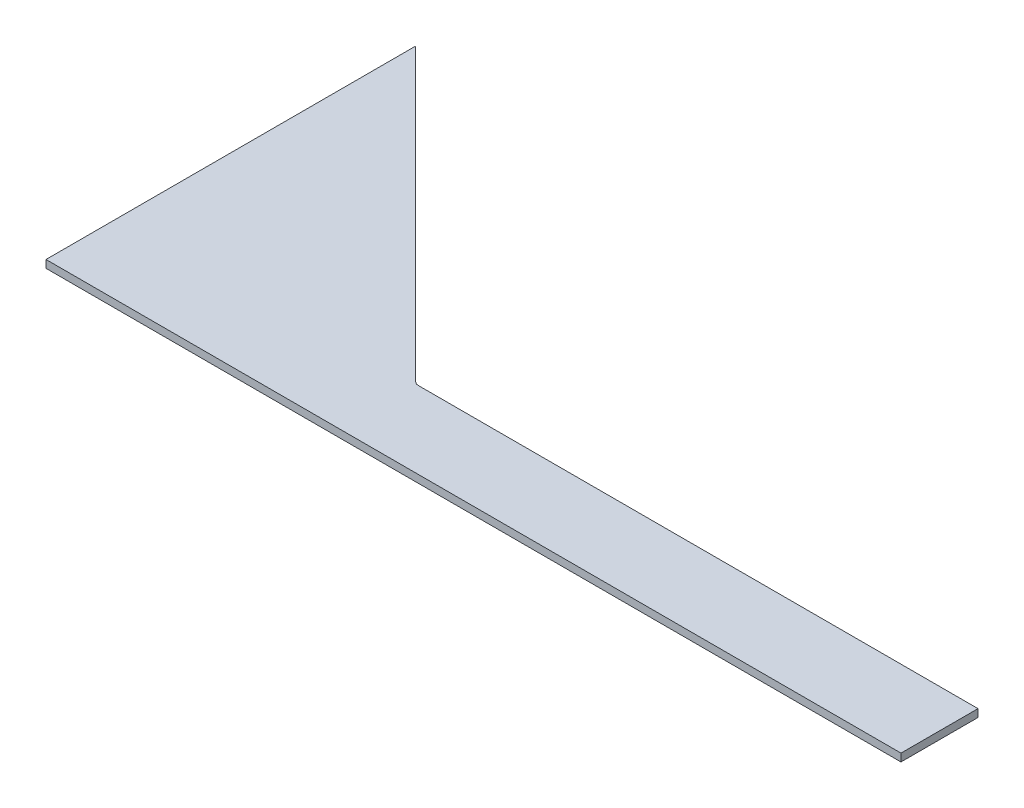
ISO-10303-21;
HEADER;
FILE_DESCRIPTION(('STEP AP214'),'2;1');
FILE_NAME('part.step','',(''),(''),'','','');
FILE_SCHEMA(('AUTOMOTIVE_DESIGN { 1 0 10303 214 1 1 1 1 }'));
ENDSEC;
DATA;
#1=APPLICATION_CONTEXT('core data for automotive mechanical design processes');
#2=APPLICATION_PROTOCOL_DEFINITION('international standard','automotive_design',2000,#1);
#3=PRODUCT_CONTEXT('',#1,'mechanical');
#4=PRODUCT('Part','Part','',(#3));
#5=PRODUCT_RELATED_PRODUCT_CATEGORY('part','',(#4));
#6=PRODUCT_DEFINITION_FORMATION('','',#4);
#7=PRODUCT_DEFINITION_CONTEXT('part definition',#1,'design');
#8=PRODUCT_DEFINITION('design','',#6,#7);
#9=PRODUCT_DEFINITION_SHAPE('','',#8);
#10=(LENGTH_UNIT() NAMED_UNIT(*) SI_UNIT(.MILLI.,.METRE.));
#11=(NAMED_UNIT(*) PLANE_ANGLE_UNIT() SI_UNIT($,.RADIAN.));
#12=(NAMED_UNIT(*) SI_UNIT($,.STERADIAN.) SOLID_ANGLE_UNIT());
#13=UNCERTAINTY_MEASURE_WITH_UNIT(LENGTH_MEASURE(1.E-05),#10,'distance_accuracy_value','');
#14=(GEOMETRIC_REPRESENTATION_CONTEXT(3) GLOBAL_UNCERTAINTY_ASSIGNED_CONTEXT((#13)) GLOBAL_UNIT_ASSIGNED_CONTEXT((#10,
#11,#12)) REPRESENTATION_CONTEXT('',''));
#15=CARTESIAN_POINT('',(0.,0.,0.));
#16=DIRECTION('',(0.,0.,1.));
#17=DIRECTION('',(1.,0.,0.));
#18=AXIS2_PLACEMENT_3D('',#15,#16,#17);
#19=CARTESIAN_POINT('',(-147.976523702142,3.175,0.));
#20=DIRECTION('',(0.,0.,1.));
#21=DIRECTION('',(1.,0.,0.));
#22=AXIS2_PLACEMENT_3D('',#19,#20,#21);
#23=PLANE('',#22);
#24=DIRECTION('',(-1.,0.,0.));
#25=VECTOR('',#24,1.);
#26=CARTESIAN_POINT('',(-147.976523702142,0.,0.));
#27=LINE('',#26,#25);
#28=CARTESIAN_POINT('',(352.425,0.,0.));
#29=VERTEX_POINT('',#28);
#30=CARTESIAN_POINT('',(0.,0.,0.));
#31=VERTEX_POINT('',#30);
#32=EDGE_CURVE('E92',#29,#31,#27,.T.);
#33=ORIENTED_EDGE('',*,*,#32,.F.);
#34=DIRECTION('',(0.,-1.,0.));
#35=VECTOR('',#34,1.);
#36=CARTESIAN_POINT('',(352.425,3.175,0.));
#37=LINE('',#36,#35);
#38=CARTESIAN_POINT('',(352.425,3.175,0.));
#39=VERTEX_POINT('',#38);
#40=EDGE_CURVE('E87',#39,#29,#37,.T.);
#41=ORIENTED_EDGE('',*,*,#40,.F.);
#42=DIRECTION('',(-1.,0.,0.));
#43=VECTOR('',#42,1.);
#44=CARTESIAN_POINT('',(-147.976523702142,3.175,0.));
#45=LINE('',#44,#43);
#46=CARTESIAN_POINT('',(0.,3.175,0.));
#47=VERTEX_POINT('',#46);
#48=EDGE_CURVE('E89',#39,#47,#45,.T.);
#49=ORIENTED_EDGE('',*,*,#48,.T.);
#50=DIRECTION('',(0.,-1.,0.));
#51=VECTOR('',#50,1.);
#52=CARTESIAN_POINT('',(0.,3.175,0.));
#53=LINE('',#52,#51);
#54=EDGE_CURVE('E120',#47,#31,#53,.T.);
#55=ORIENTED_EDGE('',*,*,#54,.T.);
#56=EDGE_LOOP('',(#33,#41,#49,#55));
#57=FACE_BOUND('',#56,.T.);
#58=ADVANCED_FACE('F36',(#57),#23,.T.);
#59=CARTESIAN_POINT('',(352.425,3.175,-51.3261523775401));
#60=DIRECTION('',(1.,0.,0.));
#61=DIRECTION('',(0.,0.,-1.));
#62=AXIS2_PLACEMENT_3D('',#59,#60,#61);
#63=PLANE('',#62);
#64=DIRECTION('',(0.,0.,1.));
#65=VECTOR('',#64,1.);
#66=CARTESIAN_POINT('',(352.425,0.,-51.3261523775401));
#67=LINE('',#66,#65);
#68=CARTESIAN_POINT('',(352.425,0.,-31.75));
#69=VERTEX_POINT('',#68);
#70=EDGE_CURVE('E122',#69,#29,#67,.T.);
#71=ORIENTED_EDGE('',*,*,#70,.F.);
#72=DIRECTION('',(0.,-1.,0.));
#73=VECTOR('',#72,1.);
#74=CARTESIAN_POINT('',(352.425,3.175,-31.75));
#75=LINE('',#74,#73);
#76=CARTESIAN_POINT('',(352.425,3.175,-31.75));
#77=VERTEX_POINT('',#76);
#78=EDGE_CURVE('E98',#77,#69,#75,.T.);
#79=ORIENTED_EDGE('',*,*,#78,.F.);
#80=DIRECTION('',(0.,0.,1.));
#81=VECTOR('',#80,1.);
#82=CARTESIAN_POINT('',(352.425,3.175,-51.3261523775401));
#83=LINE('',#82,#81);
#84=EDGE_CURVE('E103',#77,#39,#83,.T.);
#85=ORIENTED_EDGE('',*,*,#84,.T.);
#86=ORIENTED_EDGE('',*,*,#40,.T.);
#87=EDGE_LOOP('',(#71,#79,#85,#86));
#88=FACE_BOUND('',#87,.T.);
#89=ADVANCED_FACE('F110',(#88),#63,.T.);
#90=CARTESIAN_POINT('',(-147.976523702142,3.175,-31.75));
#91=DIRECTION('',(0.,0.,-1.));
#92=DIRECTION('',(-1.,0.,0.));
#93=AXIS2_PLACEMENT_3D('',#90,#91,#92);
#94=PLANE('',#93);
#95=DIRECTION('',(1.,0.,0.));
#96=VECTOR('',#95,1.);
#97=CARTESIAN_POINT('',(-147.976523702142,0.,-31.75));
#98=LINE('',#97,#96);
#99=CARTESIAN_POINT('',(121.702102448428,0.,-31.75));
#100=VERTEX_POINT('',#99);
#101=EDGE_CURVE('E124',#100,#69,#98,.T.);
#102=ORIENTED_EDGE('',*,*,#101,.F.);
#103=DIRECTION('',(0.,-1.,0.));
#104=VECTOR('',#103,1.);
#105=CARTESIAN_POINT('',(121.702102448428,3.175,-31.75));
#106=LINE('',#105,#104);
#107=CARTESIAN_POINT('',(121.702102448428,3.175,-31.75));
#108=VERTEX_POINT('',#107);
#109=EDGE_CURVE('E51',#100,#108,#106,.F.);
#110=ORIENTED_EDGE('',*,*,#109,.T.);
#111=DIRECTION('',(1.,0.,0.));
#112=VECTOR('',#111,1.);
#113=CARTESIAN_POINT('',(-147.976523702142,3.175,-31.75));
#114=LINE('',#113,#112);
#115=EDGE_CURVE('E112',#108,#77,#114,.T.);
#116=ORIENTED_EDGE('',*,*,#115,.T.);
#117=ORIENTED_EDGE('',*,*,#78,.T.);
#118=EDGE_LOOP('',(#102,#110,#116,#117));
#119=FACE_BOUND('',#118,.T.);
#120=ADVANCED_FACE('F155',(#119),#94,.T.);
#121=CARTESIAN_POINT('',(-23.4513380398412,3.175,-175.851338039841));
#122=DIRECTION('',(0.707106781186548,0.,-0.707106781186548));
#123=DIRECTION('',(-0.707106781186548,0.,-0.707106781186548));
#124=AXIS2_PLACEMENT_3D('',#121,#122,#123);
#125=PLANE('',#124);
#126=DIRECTION('',(0.707106781186548,0.,0.707106781186548));
#127=VECTOR('',#126,1.);
#128=CARTESIAN_POINT('',(-23.4513380398412,3.175,-175.851338039841));
#129=LINE('',#128,#127);
#130=CARTESIAN_POINT('',(0.,3.175,-152.4));
#131=VERTEX_POINT('',#130);
#132=CARTESIAN_POINT('',(119.906051224214,3.175,-32.4939487757861));
#133=VERTEX_POINT('',#132);
#134=EDGE_CURVE('E114',#131,#133,#129,.T.);
#135=ORIENTED_EDGE('',*,*,#134,.T.);
#136=DIRECTION('',(0.,-1.,0.));
#137=VECTOR('',#136,1.);
#138=CARTESIAN_POINT('',(119.906051224214,0.,-32.4939487757861));
#139=LINE('',#138,#137);
#140=CARTESIAN_POINT('',(119.906051224214,0.,-32.4939487757861));
#141=VERTEX_POINT('',#140);
#142=EDGE_CURVE('E97',#133,#141,#139,.T.);
#143=ORIENTED_EDGE('',*,*,#142,.T.);
#144=DIRECTION('',(0.707106781186548,0.,0.707106781186548));
#145=VECTOR('',#144,1.);
#146=CARTESIAN_POINT('',(-23.4513380398412,0.,-175.851338039841));
#147=LINE('',#146,#145);
#148=CARTESIAN_POINT('',(0.,0.,-152.4));
#149=VERTEX_POINT('',#148);
#150=EDGE_CURVE('E126',#149,#141,#147,.T.);
#151=ORIENTED_EDGE('',*,*,#150,.F.);
#152=DIRECTION('',(0.,-1.,0.));
#153=VECTOR('',#152,1.);
#154=CARTESIAN_POINT('',(0.,3.175,-152.4));
#155=LINE('',#154,#153);
#156=EDGE_CURVE('E131',#131,#149,#155,.T.);
#157=ORIENTED_EDGE('',*,*,#156,.F.);
#158=EDGE_LOOP('',(#135,#143,#151,#157));
#159=FACE_BOUND('',#158,.T.);
#160=ADVANCED_FACE('F139',(#159),#125,.T.);
#161=CARTESIAN_POINT('',(0.,3.175,-51.3261523775401));
#162=DIRECTION('',(-1.,0.,0.));
#163=DIRECTION('',(0.,0.,1.));
#164=AXIS2_PLACEMENT_3D('',#161,#162,#163);
#165=PLANE('',#164);
#166=DIRECTION('',(0.,0.,-1.));
#167=VECTOR('',#166,1.);
#168=CARTESIAN_POINT('',(0.,0.,-51.3261523775401));
#169=LINE('',#168,#167);
#170=EDGE_CURVE('E107',#31,#149,#169,.T.);
#171=ORIENTED_EDGE('',*,*,#170,.F.);
#172=ORIENTED_EDGE('',*,*,#54,.F.);
#173=DIRECTION('',(0.,0.,-1.));
#174=VECTOR('',#173,1.);
#175=CARTESIAN_POINT('',(0.,3.175,-51.3261523775401));
#176=LINE('',#175,#174);
#177=EDGE_CURVE('E106',#47,#131,#176,.T.);
#178=ORIENTED_EDGE('',*,*,#177,.T.);
#179=ORIENTED_EDGE('',*,*,#156,.T.);
#180=EDGE_LOOP('',(#171,#172,#178,#179));
#181=FACE_BOUND('',#180,.T.);
#182=ADVANCED_FACE('F145',(#181),#165,.T.);
#183=CARTESIAN_POINT('',(-147.976523702142,3.175,-51.3261523775401));
#184=DIRECTION('',(0.,1.,0.));
#185=DIRECTION('',(0.,0.,1.));
#186=AXIS2_PLACEMENT_3D('',#183,#184,#185);
#187=PLANE('',#186);
#188=ORIENTED_EDGE('',*,*,#48,.F.);
#189=ORIENTED_EDGE('',*,*,#84,.F.);
#190=ORIENTED_EDGE('',*,*,#115,.F.);
#191=CARTESIAN_POINT('',(121.702102448428,3.175,-34.29));
#192=DIRECTION('',(0.,1.,0.));
#193=DIRECTION('',(0.,0.,1.));
#194=AXIS2_PLACEMENT_3D('',#191,#192,#193);
#195=CIRCLE('',#194,2.54);
#196=EDGE_CURVE('E11',#108,#133,#195,.F.);
#197=ORIENTED_EDGE('',*,*,#196,.T.);
#198=ORIENTED_EDGE('',*,*,#134,.F.);
#199=ORIENTED_EDGE('',*,*,#177,.F.);
#200=EDGE_LOOP('',(#188,#189,#190,#197,#198,#199));
#201=FACE_BOUND('',#200,.T.);
#202=ADVANCED_FACE('F102',(#201),#187,.T.);
#203=CARTESIAN_POINT('',(-147.976523702142,0.,-51.3261523775401));
#204=DIRECTION('',(0.,1.,0.));
#205=DIRECTION('',(0.,0.,1.));
#206=AXIS2_PLACEMENT_3D('',#203,#204,#205);
#207=PLANE('',#206);
#208=ORIENTED_EDGE('',*,*,#32,.T.);
#209=ORIENTED_EDGE('',*,*,#170,.T.);
#210=ORIENTED_EDGE('',*,*,#150,.T.);
#211=CARTESIAN_POINT('',(121.702102448428,0.,-34.29));
#212=DIRECTION('',(0.,1.,0.));
#213=DIRECTION('',(0.,0.,1.));
#214=AXIS2_PLACEMENT_3D('',#211,#212,#213);
#215=CIRCLE('',#214,2.54);
#216=EDGE_CURVE('E44',#141,#100,#215,.T.);
#217=ORIENTED_EDGE('',*,*,#216,.T.);
#218=ORIENTED_EDGE('',*,*,#101,.T.);
#219=ORIENTED_EDGE('',*,*,#70,.T.);
#220=EDGE_LOOP('',(#208,#209,#210,#217,#218,#219));
#221=FACE_BOUND('',#220,.T.);
#222=ADVANCED_FACE('F142',(#221),#207,.F.);
#223=CARTESIAN_POINT('',(121.702102448428,3.175,-34.29));
#224=DIRECTION('',(0.,1.,0.));
#225=DIRECTION('',(0.,0.,1.));
#226=AXIS2_PLACEMENT_3D('',#223,#224,#225);
#227=CYLINDRICAL_SURFACE('',#226,2.54);
#228=ORIENTED_EDGE('',*,*,#196,.F.);
#229=ORIENTED_EDGE('',*,*,#109,.F.);
#230=ORIENTED_EDGE('',*,*,#216,.F.);
#231=ORIENTED_EDGE('',*,*,#142,.F.);
#232=EDGE_LOOP('',(#228,#229,#230,#231));
#233=FACE_BOUND('',#232,.T.);
#234=ADVANCED_FACE('F38',(#233),#227,.F.);
#235=CLOSED_SHELL('',(#58,#89,#120,#160,#182,#202,#222,#234));
#236=MANIFOLD_SOLID_BREP('B2',#235);
#237=ADVANCED_BREP_SHAPE_REPRESENTATION('',(#18,#236),#14);
#238=SHAPE_DEFINITION_REPRESENTATION(#9,#237);
ENDSEC;
END-ISO-10303-21;
